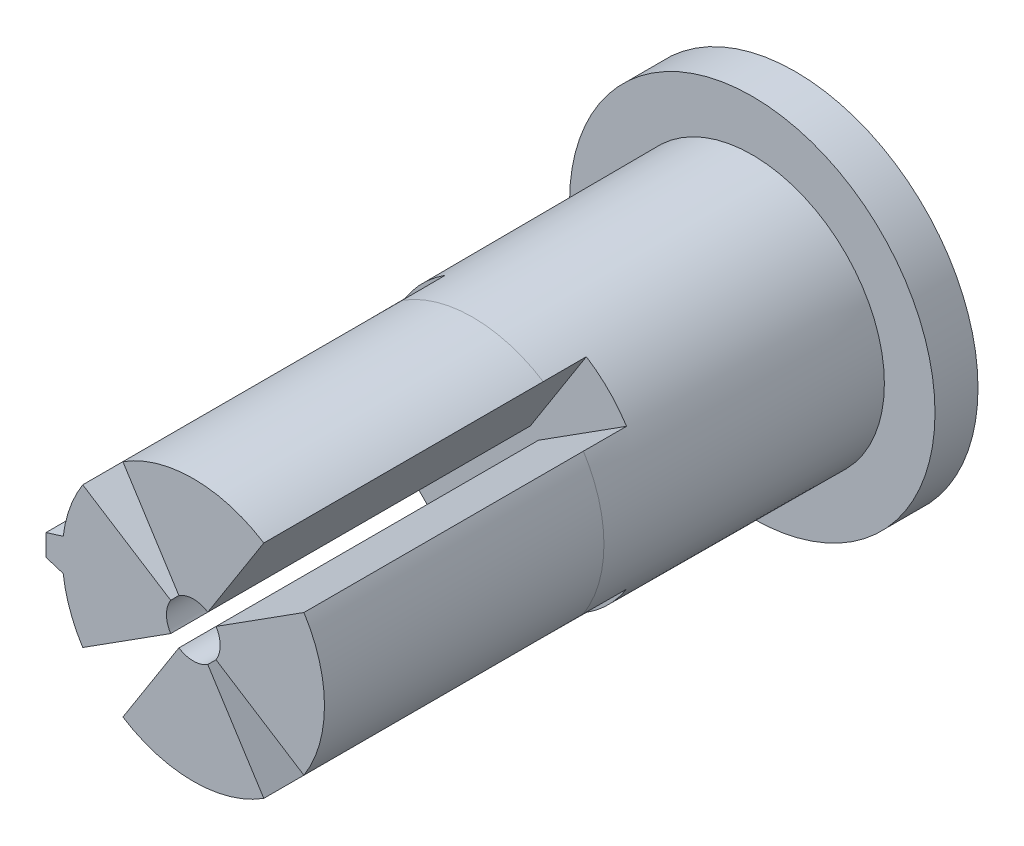
ISO-10303-21;
HEADER;
FILE_DESCRIPTION(('STEP AP214'),'2;1');
FILE_NAME('part.step','',(''),(''),'','','');
FILE_SCHEMA(('AUTOMOTIVE_DESIGN { 1 0 10303 214 1 1 1 1 }'));
ENDSEC;
DATA;
#1=APPLICATION_CONTEXT('core data for automotive mechanical design processes');
#2=APPLICATION_PROTOCOL_DEFINITION('international standard','automotive_design',2000,#1);
#3=PRODUCT_CONTEXT('',#1,'mechanical');
#4=PRODUCT('Part','Part','',(#3));
#5=PRODUCT_RELATED_PRODUCT_CATEGORY('part','',(#4));
#6=PRODUCT_DEFINITION_FORMATION('','',#4);
#7=PRODUCT_DEFINITION_CONTEXT('part definition',#1,'design');
#8=PRODUCT_DEFINITION('design','',#6,#7);
#9=PRODUCT_DEFINITION_SHAPE('','',#8);
#10=(LENGTH_UNIT() NAMED_UNIT(*) SI_UNIT(.MILLI.,.METRE.));
#11=(NAMED_UNIT(*) PLANE_ANGLE_UNIT() SI_UNIT($,.RADIAN.));
#12=(NAMED_UNIT(*) SI_UNIT($,.STERADIAN.) SOLID_ANGLE_UNIT());
#13=UNCERTAINTY_MEASURE_WITH_UNIT(LENGTH_MEASURE(1.E-05),#10,'distance_accuracy_value','');
#14=(GEOMETRIC_REPRESENTATION_CONTEXT(3) GLOBAL_UNCERTAINTY_ASSIGNED_CONTEXT((#13)) GLOBAL_UNIT_ASSIGNED_CONTEXT((#10,
#11,#12)) REPRESENTATION_CONTEXT('',''));
#15=CARTESIAN_POINT('',(0.,0.,0.));
#16=DIRECTION('',(0.,0.,1.));
#17=DIRECTION('',(1.,0.,0.));
#18=AXIS2_PLACEMENT_3D('',#15,#16,#17);
#19=CARTESIAN_POINT('',(0.,0.,13.));
#20=DIRECTION('',(0.,0.,-1.));
#21=DIRECTION('',(-1.,0.,0.));
#22=AXIS2_PLACEMENT_3D('',#19,#20,#21);
#23=CYLINDRICAL_SURFACE('',#22,6.1);
#24=CARTESIAN_POINT('',(0.,0.,13.));
#25=DIRECTION('',(0.,0.,1.));
#26=DIRECTION('',(1.,0.,0.));
#27=AXIS2_PLACEMENT_3D('',#24,#25,#26);
#28=CIRCLE('',#27,6.1);
#29=CARTESIAN_POINT('',(-3.27752761091559,-5.14468781945862,13.));
#30=VERTEX_POINT('',#29);
#31=CARTESIAN_POINT('',(3.27752761091566,-5.14468781945858,13.));
#32=VERTEX_POINT('',#31);
#33=EDGE_CURVE('E377',#30,#32,#28,.T.);
#34=ORIENTED_EDGE('',*,*,#33,.F.);
#35=DIRECTION('',(0.,0.,-1.));
#36=VECTOR('',#35,1.);
#37=CARTESIAN_POINT('',(-3.27752761091559,-5.14468781945862,13.));
#38=LINE('',#37,#36);
#39=CARTESIAN_POINT('',(-3.27752761091559,-5.14468781945862,0.));
#40=VERTEX_POINT('',#39);
#41=EDGE_CURVE('E288',#30,#40,#38,.T.);
#42=ORIENTED_EDGE('',*,*,#41,.T.);
#43=CARTESIAN_POINT('',(0.,0.,0.));
#44=DIRECTION('',(0.,0.,1.));
#45=DIRECTION('',(1.,0.,0.));
#46=AXIS2_PLACEMENT_3D('',#43,#44,#45);
#47=CIRCLE('',#46,6.1);
#48=CARTESIAN_POINT('',(3.27752761091565,-5.14468781945858,0.));
#49=VERTEX_POINT('',#48);
#50=EDGE_CURVE('E411',#40,#49,#47,.T.);
#51=ORIENTED_EDGE('',*,*,#50,.T.);
#52=DIRECTION('',(0.,0.,-1.));
#53=VECTOR('',#52,1.);
#54=CARTESIAN_POINT('',(3.27752761091565,-5.14468781945858,13.));
#55=LINE('',#54,#53);
#56=EDGE_CURVE('E303',#49,#32,#55,.F.);
#57=ORIENTED_EDGE('',*,*,#56,.T.);
#58=EDGE_LOOP('',(#34,#42,#51,#57));
#59=FACE_BOUND('',#58,.T.);
#60=ADVANCED_FACE('F38',(#59),#23,.T.);
#61=CARTESIAN_POINT('',(5.14468781945862,-3.27752761091559,13.));
#62=VERTEX_POINT('',#61);
#63=CARTESIAN_POINT('',(5.14468781945858,3.27752761091565,13.));
#64=VERTEX_POINT('',#63);
#65=EDGE_CURVE('E375',#62,#64,#28,.T.);
#66=ORIENTED_EDGE('',*,*,#65,.F.);
#67=DIRECTION('',(0.,0.,-1.));
#68=VECTOR('',#67,1.);
#69=CARTESIAN_POINT('',(5.14468781945862,-3.27752761091559,13.));
#70=LINE('',#69,#68);
#71=CARTESIAN_POINT('',(5.14468781945862,-3.27752761091559,0.));
#72=VERTEX_POINT('',#71);
#73=EDGE_CURVE('E298',#62,#72,#70,.T.);
#74=ORIENTED_EDGE('',*,*,#73,.T.);
#75=CARTESIAN_POINT('',(5.14468781945858,3.27752761091565,0.));
#76=VERTEX_POINT('',#75);
#77=EDGE_CURVE('E914',#72,#76,#47,.T.);
#78=ORIENTED_EDGE('',*,*,#77,.T.);
#79=DIRECTION('',(0.,0.,-1.));
#80=VECTOR('',#79,1.);
#81=CARTESIAN_POINT('',(5.14468781945858,3.27752761091565,13.));
#82=LINE('',#81,#80);
#83=EDGE_CURVE('E311',#76,#64,#82,.F.);
#84=ORIENTED_EDGE('',*,*,#83,.T.);
#85=EDGE_LOOP('',(#66,#74,#78,#84));
#86=FACE_BOUND('',#85,.T.);
#87=ADVANCED_FACE('F455',(#86),#23,.T.);
#88=CARTESIAN_POINT('',(3.27752761091559,5.14468781945862,13.));
#89=VERTEX_POINT('',#88);
#90=CARTESIAN_POINT('',(-3.27752761091565,5.14468781945858,13.));
#91=VERTEX_POINT('',#90);
#92=EDGE_CURVE('E378',#89,#91,#28,.T.);
#93=ORIENTED_EDGE('',*,*,#92,.F.);
#94=DIRECTION('',(0.,0.,-1.));
#95=VECTOR('',#94,1.);
#96=CARTESIAN_POINT('',(3.27752761091559,5.14468781945862,13.));
#97=LINE('',#96,#95);
#98=CARTESIAN_POINT('',(3.27752761091559,5.14468781945862,0.));
#99=VERTEX_POINT('',#98);
#100=EDGE_CURVE('E233',#89,#99,#97,.T.);
#101=ORIENTED_EDGE('',*,*,#100,.T.);
#102=CARTESIAN_POINT('',(-3.27752761091565,5.14468781945858,0.));
#103=VERTEX_POINT('',#102);
#104=EDGE_CURVE('E887',#99,#103,#47,.T.);
#105=ORIENTED_EDGE('',*,*,#104,.T.);
#106=DIRECTION('',(0.,0.,-1.));
#107=VECTOR('',#106,1.);
#108=CARTESIAN_POINT('',(-3.27752761091565,5.14468781945858,13.));
#109=LINE('',#108,#107);
#110=EDGE_CURVE('E321',#103,#91,#109,.F.);
#111=ORIENTED_EDGE('',*,*,#110,.T.);
#112=EDGE_LOOP('',(#93,#101,#105,#111));
#113=FACE_BOUND('',#112,.T.);
#114=ADVANCED_FACE('F460',(#113),#23,.T.);
#115=CARTESIAN_POINT('',(-5.14468781945862,3.27752761091559,13.));
#116=VERTEX_POINT('',#115);
#117=CARTESIAN_POINT('',(-6.05371786590687,0.75,13.));
#118=VERTEX_POINT('',#117);
#119=EDGE_CURVE('E382',#116,#118,#28,.T.);
#120=ORIENTED_EDGE('',*,*,#119,.F.);
#121=DIRECTION('',(0.,0.,-1.));
#122=VECTOR('',#121,1.);
#123=CARTESIAN_POINT('',(-5.14468781945862,3.27752761091559,13.));
#124=LINE('',#123,#122);
#125=CARTESIAN_POINT('',(-5.14468781945862,3.27752761091559,0.));
#126=VERTEX_POINT('',#125);
#127=EDGE_CURVE('E316',#116,#126,#124,.T.);
#128=ORIENTED_EDGE('',*,*,#127,.T.);
#129=CARTESIAN_POINT('',(-6.05371786590687,0.75,0.));
#130=VERTEX_POINT('',#129);
#131=EDGE_CURVE('E406',#126,#130,#47,.T.);
#132=ORIENTED_EDGE('',*,*,#131,.T.);
#133=DIRECTION('',(0.,0.,-1.));
#134=VECTOR('',#133,1.);
#135=CARTESIAN_POINT('',(-6.05371786590687,0.75,13.));
#136=LINE('',#135,#134);
#137=EDGE_CURVE('E403',#118,#130,#136,.T.);
#138=ORIENTED_EDGE('',*,*,#137,.F.);
#139=EDGE_LOOP('',(#120,#128,#132,#138));
#140=FACE_BOUND('',#139,.T.);
#141=ADVANCED_FACE('F451',(#140),#23,.T.);
#142=CARTESIAN_POINT('',(0.,0.,13.));
#143=DIRECTION('',(0.,0.,1.));
#144=DIRECTION('',(1.,0.,0.));
#145=AXIS2_PLACEMENT_3D('',#142,#143,#144);
#146=PLANE('',#145);
#147=DIRECTION('',(0.537299608346819,0.843391445812889,0.));
#148=VECTOR('',#147,1.);
#149=CARTESIAN_POINT('',(-0.671624510433523,-1.05423930726611,13.));
#150=LINE('',#149,#148);
#151=CARTESIAN_POINT('',(-0.671624510433523,-1.05423930726611,13.));
#152=VERTEX_POINT('',#151);
#153=EDGE_CURVE('E341',#30,#152,#150,.T.);
#154=ORIENTED_EDGE('',*,*,#153,.F.);
#155=ORIENTED_EDGE('',*,*,#33,.T.);
#156=DIRECTION('',(0.537299608346829,-0.843391445812883,0.));
#157=VECTOR('',#156,1.);
#158=CARTESIAN_POINT('',(0.671624510433536,-1.0542393072661,13.));
#159=LINE('',#158,#157);
#160=CARTESIAN_POINT('',(0.671624510433536,-1.0542393072661,13.));
#161=VERTEX_POINT('',#160);
#162=EDGE_CURVE('E250',#161,#32,#159,.T.);
#163=ORIENTED_EDGE('',*,*,#162,.F.);
#164=CARTESIAN_POINT('',(0.,0.,13.));
#165=DIRECTION('',(0.,0.,1.));
#166=DIRECTION('',(1.,0.,0.));
#167=AXIS2_PLACEMENT_3D('',#164,#165,#166);
#168=CIRCLE('',#167,1.25);
#169=EDGE_CURVE('E263',#152,#161,#168,.T.);
#170=ORIENTED_EDGE('',*,*,#169,.F.);
#171=EDGE_LOOP('',(#154,#155,#163,#170));
#172=FACE_BOUND('',#171,.T.);
#173=ADVANCED_FACE('F479',(#172),#146,.T.);
#174=DIRECTION('',(-0.843391445812889,0.537299608346819,0.));
#175=VECTOR('',#174,1.);
#176=CARTESIAN_POINT('',(1.05423930726611,-0.671624510433523,13.));
#177=LINE('',#176,#175);
#178=CARTESIAN_POINT('',(1.05423930726611,-0.671624510433523,13.));
#179=VERTEX_POINT('',#178);
#180=EDGE_CURVE('E353',#62,#179,#177,.T.);
#181=ORIENTED_EDGE('',*,*,#180,.F.);
#182=ORIENTED_EDGE('',*,*,#65,.T.);
#183=DIRECTION('',(0.843391445812883,0.537299608346829,0.));
#184=VECTOR('',#183,1.);
#185=CARTESIAN_POINT('',(1.0542393072661,0.671624510433536,13.));
#186=LINE('',#185,#184);
#187=CARTESIAN_POINT('',(1.0542393072661,0.671624510433536,13.));
#188=VERTEX_POINT('',#187);
#189=EDGE_CURVE('E238',#188,#64,#186,.T.);
#190=ORIENTED_EDGE('',*,*,#189,.F.);
#191=EDGE_CURVE('E258',#179,#188,#168,.T.);
#192=ORIENTED_EDGE('',*,*,#191,.F.);
#193=EDGE_LOOP('',(#181,#182,#190,#192));
#194=FACE_BOUND('',#193,.T.);
#195=ADVANCED_FACE('F373',(#194),#146,.T.);
#196=DIRECTION('',(-0.537299608346819,-0.843391445812889,0.));
#197=VECTOR('',#196,1.);
#198=CARTESIAN_POINT('',(0.671624510433523,1.05423930726611,13.));
#199=LINE('',#198,#197);
#200=CARTESIAN_POINT('',(0.671624510433523,1.05423930726611,13.));
#201=VERTEX_POINT('',#200);
#202=EDGE_CURVE('E226',#89,#201,#199,.T.);
#203=ORIENTED_EDGE('',*,*,#202,.F.);
#204=ORIENTED_EDGE('',*,*,#92,.T.);
#205=DIRECTION('',(-0.537299608346828,0.843391445812883,0.));
#206=VECTOR('',#205,1.);
#207=CARTESIAN_POINT('',(-0.671624510433536,1.0542393072661,13.));
#208=LINE('',#207,#206);
#209=CARTESIAN_POINT('',(-0.671624510433536,1.0542393072661,13.));
#210=VERTEX_POINT('',#209);
#211=EDGE_CURVE('E254',#210,#91,#208,.T.);
#212=ORIENTED_EDGE('',*,*,#211,.F.);
#213=EDGE_CURVE('E246',#201,#210,#168,.T.);
#214=ORIENTED_EDGE('',*,*,#213,.F.);
#215=EDGE_LOOP('',(#203,#204,#212,#214));
#216=FACE_BOUND('',#215,.T.);
#217=ADVANCED_FACE('F253',(#216),#146,.T.);
#218=CARTESIAN_POINT('',(0.,0.,-2.));
#219=DIRECTION('',(0.,0.,1.));
#220=DIRECTION('',(1.,0.,0.));
#221=AXIS2_PLACEMENT_3D('',#218,#219,#220);
#222=CYLINDRICAL_SURFACE('',#221,1.25);
#223=CARTESIAN_POINT('',(0.,0.,-2.));
#224=DIRECTION('',(0.,0.,1.));
#225=DIRECTION('',(1.,0.,0.));
#226=AXIS2_PLACEMENT_3D('',#223,#224,#225);
#227=CIRCLE('',#226,1.25);
#228=CARTESIAN_POINT('',(-0.671624510433523,-1.05423930726611,-2.));
#229=VERTEX_POINT('',#228);
#230=CARTESIAN_POINT('',(0.671624510433536,-1.0542393072661,-2.));
#231=VERTEX_POINT('',#230);
#232=EDGE_CURVE('E260',#229,#231,#227,.T.);
#233=ORIENTED_EDGE('',*,*,#232,.F.);
#234=DIRECTION('',(0.,0.,1.));
#235=VECTOR('',#234,1.);
#236=CARTESIAN_POINT('',(-0.671624510433523,-1.05423930726611,-2.));
#237=LINE('',#236,#235);
#238=EDGE_CURVE('E63',#229,#152,#237,.T.);
#239=ORIENTED_EDGE('',*,*,#238,.T.);
#240=ORIENTED_EDGE('',*,*,#169,.T.);
#241=DIRECTION('',(0.,0.,1.));
#242=VECTOR('',#241,1.);
#243=CARTESIAN_POINT('',(0.671624510433536,-1.0542393072661,-2.));
#244=LINE('',#243,#242);
#245=EDGE_CURVE('E356',#231,#161,#244,.T.);
#246=ORIENTED_EDGE('',*,*,#245,.F.);
#247=EDGE_LOOP('',(#233,#239,#240,#246));
#248=FACE_BOUND('',#247,.T.);
#249=ADVANCED_FACE('F508',(#248),#222,.F.);
#250=CARTESIAN_POINT('',(1.05423930726611,-0.671624510433523,-2.));
#251=VERTEX_POINT('',#250);
#252=CARTESIAN_POINT('',(1.0542393072661,0.671624510433536,-2.));
#253=VERTEX_POINT('',#252);
#254=EDGE_CURVE('E255',#251,#253,#227,.T.);
#255=ORIENTED_EDGE('',*,*,#254,.F.);
#256=DIRECTION('',(0.,0.,1.));
#257=VECTOR('',#256,1.);
#258=CARTESIAN_POINT('',(1.05423930726611,-0.671624510433523,-2.));
#259=LINE('',#258,#257);
#260=EDGE_CURVE('E55',#251,#179,#259,.T.);
#261=ORIENTED_EDGE('',*,*,#260,.T.);
#262=ORIENTED_EDGE('',*,*,#191,.T.);
#263=DIRECTION('',(0.,0.,1.));
#264=VECTOR('',#263,1.);
#265=CARTESIAN_POINT('',(1.0542393072661,0.671624510433536,-2.));
#266=LINE('',#265,#264);
#267=EDGE_CURVE('E249',#253,#188,#266,.T.);
#268=ORIENTED_EDGE('',*,*,#267,.F.);
#269=EDGE_LOOP('',(#255,#261,#262,#268));
#270=FACE_BOUND('',#269,.T.);
#271=ADVANCED_FACE('F666',(#270),#222,.F.);
#272=CARTESIAN_POINT('',(0.671624510433523,1.05423930726611,-2.));
#273=VERTEX_POINT('',#272);
#274=CARTESIAN_POINT('',(-0.671624510433536,1.0542393072661,-2.));
#275=VERTEX_POINT('',#274);
#276=EDGE_CURVE('E248',#273,#275,#227,.T.);
#277=ORIENTED_EDGE('',*,*,#276,.F.);
#278=DIRECTION('',(0.,0.,1.));
#279=VECTOR('',#278,1.);
#280=CARTESIAN_POINT('',(0.671624510433523,1.05423930726611,-2.));
#281=LINE('',#280,#279);
#282=EDGE_CURVE('E230',#273,#201,#281,.T.);
#283=ORIENTED_EDGE('',*,*,#282,.T.);
#284=ORIENTED_EDGE('',*,*,#213,.T.);
#285=DIRECTION('',(0.,0.,1.));
#286=VECTOR('',#285,1.);
#287=CARTESIAN_POINT('',(-0.671624510433536,1.0542393072661,-2.));
#288=LINE('',#287,#286);
#289=EDGE_CURVE('E325',#275,#210,#288,.T.);
#290=ORIENTED_EDGE('',*,*,#289,.F.);
#291=EDGE_LOOP('',(#277,#283,#284,#290));
#292=FACE_BOUND('',#291,.T.);
#293=ADVANCED_FACE('F244',(#292),#222,.F.);
#294=CARTESIAN_POINT('',(0.,0.,0.));
#295=DIRECTION('',(0.,0.,-1.));
#296=DIRECTION('',(1.,0.,0.));
#297=AXIS2_PLACEMENT_3D('',#294,#295,#296);
#298=CONICAL_SURFACE('',#297,6.1,0.00349065850398867);
#299=DIRECTION('',(-0.00187552563827498,-0.00294398554391436,-0.99999390765779));
#300=VECTOR('',#299,1.);
#301=CARTESIAN_POINT('',(0.,0.,1747.51417747095));
#302=LINE('',#301,#300);
#303=CARTESIAN_POINT('',(-3.28127868504497,-5.1505758264182,-2.));
#304=VERTEX_POINT('',#303);
#305=EDGE_CURVE('E286',#304,#40,#302,.F.);
#306=ORIENTED_EDGE('',*,*,#305,.F.);
#307=CARTESIAN_POINT('',(0.,0.,-2.));
#308=DIRECTION('',(0.,0.,1.));
#309=DIRECTION('',(1.,0.,0.));
#310=AXIS2_PLACEMENT_3D('',#307,#308,#309);
#311=CIRCLE('',#310,6.10698134536319);
#312=CARTESIAN_POINT('',(-5.15057582641816,-3.28127868504503,-2.));
#313=VERTEX_POINT('',#312);
#314=EDGE_CURVE('E266',#304,#313,#311,.F.);
#315=ORIENTED_EDGE('',*,*,#314,.T.);
#316=DIRECTION('',(0.00294398554391434,0.00187552563827502,0.999993907657791));
#317=VECTOR('',#316,1.);
#318=CARTESIAN_POINT('',(0.,0.,1747.51417747095));
#319=LINE('',#318,#317);
#320=CARTESIAN_POINT('',(-5.14468781945858,-3.27752761091565,0.));
#321=VERTEX_POINT('',#320);
#322=EDGE_CURVE('E291',#321,#313,#319,.F.);
#323=ORIENTED_EDGE('',*,*,#322,.F.);
#324=CARTESIAN_POINT('',(-6.05371786590687,-0.75,0.));
#325=VERTEX_POINT('',#324);
#326=EDGE_CURVE('E407',#325,#321,#47,.T.);
#327=ORIENTED_EDGE('',*,*,#326,.F.);
#328=CARTESIAN_POINT('',(-6.09508474462202,-0.784615749053169,-13.));
#329=CARTESIAN_POINT('',(-6.08820240831536,-0.778842662602694,-10.833333304797));
#330=CARTESIAN_POINT('',(-6.08131400026911,-0.773071473623027,-8.66666662386222));
#331=CARTESIAN_POINT('',(-6.06752504069739,-0.761532890605304,-4.33333329052888));
#332=CARTESIAN_POINT('',(-6.06062448917193,-0.755765496567249,-2.16666663813034));
#333=CARTESIAN_POINT('',(-6.05371786590687,-0.75,0.));
#334=B_SPLINE_CURVE_WITH_KNOTS('',3,(#328,#329,#330,#331,#332,#333),.UNSPECIFIED.,.F.,.F.,(4,2,
4),(0.,6.50005595110887,13.0001119022181),.UNSPECIFIED.);
#335=CARTESIAN_POINT('',(-6.09508474462202,-0.784615749053169,-13.));
#336=VERTEX_POINT('',#335);
#337=EDGE_CURVE('E11',#336,#325,#334,.T.);
#338=ORIENTED_EDGE('',*,*,#337,.F.);
#339=CARTESIAN_POINT('',(0.,0.,-13.));
#340=DIRECTION('',(0.,0.,1.));
#341=DIRECTION('',(1.,0.,0.));
#342=AXIS2_PLACEMENT_3D('',#339,#340,#341);
#343=CIRCLE('',#342,6.14537874486075);
#344=CARTESIAN_POINT('',(-6.09508474462202,0.784615749053169,-13.));
#345=VERTEX_POINT('',#344);
#346=EDGE_CURVE('E419',#336,#345,#343,.T.);
#347=ORIENTED_EDGE('',*,*,#346,.T.);
#348=CARTESIAN_POINT('',(-6.09508474462202,0.784615749053169,-13.));
#349=CARTESIAN_POINT('',(-6.08820240831536,0.778842662602694,-10.833333304797));
#350=CARTESIAN_POINT('',(-6.08131400026911,0.773071473623027,-8.66666662386222));
#351=CARTESIAN_POINT('',(-6.06752504069739,0.761532890605304,-4.33333329052888));
#352=CARTESIAN_POINT('',(-6.06062448917193,0.755765496567249,-2.16666663813034));
#353=CARTESIAN_POINT('',(-6.05371786590687,0.75,0.));
#354=B_SPLINE_CURVE_WITH_KNOTS('',3,(#348,#349,#350,#351,#352,#353),.UNSPECIFIED.,.F.,.F.,(4,2,
4),(0.,6.50005595110887,13.0001119022181),.UNSPECIFIED.);
#355=EDGE_CURVE('E427',#345,#130,#354,.T.);
#356=ORIENTED_EDGE('',*,*,#355,.T.);
#357=ORIENTED_EDGE('',*,*,#131,.F.);
#358=DIRECTION('',(-0.00294398554391436,0.00187552563827498,-0.99999390765779));
#359=VECTOR('',#358,1.);
#360=CARTESIAN_POINT('',(0.,0.,1747.51417747095));
#361=LINE('',#360,#359);
#362=CARTESIAN_POINT('',(-5.1505758264182,3.28127868504497,-2.));
#363=VERTEX_POINT('',#362);
#364=EDGE_CURVE('E314',#363,#126,#361,.F.);
#365=ORIENTED_EDGE('',*,*,#364,.F.);
#366=CARTESIAN_POINT('',(0.,0.,-2.));
#367=DIRECTION('',(0.,0.,1.));
#368=DIRECTION('',(1.,0.,0.));
#369=AXIS2_PLACEMENT_3D('',#366,#367,#368);
#370=CIRCLE('',#369,6.10698134536319);
#371=CARTESIAN_POINT('',(-3.28127868504503,5.15057582641817,-2.));
#372=VERTEX_POINT('',#371);
#373=EDGE_CURVE('E283',#363,#372,#370,.F.);
#374=ORIENTED_EDGE('',*,*,#373,.T.);
#375=DIRECTION('',(0.00187552563827502,-0.00294398554391434,0.999993907657791));
#376=VECTOR('',#375,1.);
#377=CARTESIAN_POINT('',(0.,0.,1747.51417747095));
#378=LINE('',#377,#376);
#379=EDGE_CURVE('E319',#103,#372,#378,.F.);
#380=ORIENTED_EDGE('',*,*,#379,.F.);
#381=ORIENTED_EDGE('',*,*,#104,.F.);
#382=DIRECTION('',(0.00187552563827498,0.00294398554391436,-0.99999390765779));
#383=VECTOR('',#382,1.);
#384=CARTESIAN_POINT('',(0.,0.,1747.51417747095));
#385=LINE('',#384,#383);
#386=CARTESIAN_POINT('',(3.28127868504497,5.1505758264182,-2.));
#387=VERTEX_POINT('',#386);
#388=EDGE_CURVE('E306',#387,#99,#385,.F.);
#389=ORIENTED_EDGE('',*,*,#388,.F.);
#390=CARTESIAN_POINT('',(0.,0.,-2.));
#391=DIRECTION('',(0.,0.,1.));
#392=DIRECTION('',(1.,0.,0.));
#393=AXIS2_PLACEMENT_3D('',#390,#391,#392);
#394=CIRCLE('',#393,6.10698134536319);
#395=CARTESIAN_POINT('',(5.15057582641817,3.28127868504503,-2.));
#396=VERTEX_POINT('',#395);
#397=EDGE_CURVE('E278',#387,#396,#394,.F.);
#398=ORIENTED_EDGE('',*,*,#397,.T.);
#399=DIRECTION('',(-0.00294398554391433,-0.00187552563827502,0.99999390765779));
#400=VECTOR('',#399,1.);
#401=CARTESIAN_POINT('',(0.,0.,1747.51417747095));
#402=LINE('',#401,#400);
#403=EDGE_CURVE('E309',#76,#396,#402,.F.);
#404=ORIENTED_EDGE('',*,*,#403,.F.);
#405=ORIENTED_EDGE('',*,*,#77,.F.);
#406=DIRECTION('',(0.00294398554391436,-0.00187552563827498,-0.99999390765779));
#407=VECTOR('',#406,1.);
#408=CARTESIAN_POINT('',(0.,0.,1747.51417747095));
#409=LINE('',#408,#407);
#410=CARTESIAN_POINT('',(5.1505758264182,-3.28127868504497,-2.));
#411=VERTEX_POINT('',#410);
#412=EDGE_CURVE('E296',#411,#72,#409,.F.);
#413=ORIENTED_EDGE('',*,*,#412,.F.);
#414=CARTESIAN_POINT('',(0.,0.,-2.));
#415=DIRECTION('',(0.,0.,1.));
#416=DIRECTION('',(1.,0.,0.));
#417=AXIS2_PLACEMENT_3D('',#414,#415,#416);
#418=CIRCLE('',#417,6.10698134536319);
#419=CARTESIAN_POINT('',(3.28127868504503,-5.15057582641817,-2.));
#420=VERTEX_POINT('',#419);
#421=EDGE_CURVE('E272',#411,#420,#418,.F.);
#422=ORIENTED_EDGE('',*,*,#421,.T.);
#423=DIRECTION('',(-0.00187552563827502,0.00294398554391433,0.99999390765779));
#424=VECTOR('',#423,1.);
#425=CARTESIAN_POINT('',(0.,0.,1747.51417747095));
#426=LINE('',#425,#424);
#427=EDGE_CURVE('E301',#49,#420,#426,.F.);
#428=ORIENTED_EDGE('',*,*,#427,.F.);
#429=ORIENTED_EDGE('',*,*,#50,.F.);
#430=EDGE_LOOP('',(#306,#315,#323,#327,#338,#347,#356,#357,#365,#374,#380,#381,#389,#398,#404,
#405,#413,#422,#428,#429));
#431=FACE_BOUND('',#430,.T.);
#432=ADVANCED_FACE('F433',(#431),#298,.T.);
#433=CARTESIAN_POINT('',(-6.05371786590687,-0.75,0.));
#434=DIRECTION('',(-0.298273175942616,-0.954474163016371,0.00349065141522374));
#435=DIRECTION('',(0.95447997803503,-0.298274993135947,0.));
#436=AXIS2_PLACEMENT_3D('',#433,#434,#435);
#437=PLANE('',#436);
#438=DIRECTION('',(0.95447997803503,-0.298274993135947,0.));
#439=VECTOR('',#438,1.);
#440=CARTESIAN_POINT('',(-6.05371786590687,-0.75,0.));
#441=LINE('',#440,#439);
#442=CARTESIAN_POINT('',(-6.85371786590687,-0.5,0.));
#443=VERTEX_POINT('',#442);
#444=EDGE_CURVE('E417',#443,#325,#441,.T.);
#445=ORIENTED_EDGE('',*,*,#444,.F.);
#446=DIRECTION('',(0.00349063992079044,0.00256628675168157,0.999990614758584));
#447=VECTOR('',#446,1.);
#448=CARTESIAN_POINT('',(-6.85371786590687,-0.5,0.));
#449=LINE('',#448,#447);
#450=CARTESIAN_POINT('',(-6.89909661076762,-0.533362040882668,-13.));
#451=VERTEX_POINT('',#450);
#452=EDGE_CURVE('E47',#451,#443,#449,.T.);
#453=ORIENTED_EDGE('',*,*,#452,.F.);
#454=DIRECTION('',(0.95447997803503,-0.298274993135947,0.));
#455=VECTOR('',#454,1.);
#456=CARTESIAN_POINT('',(-0.765645475230618,-2.45006552073798,-13.));
#457=LINE('',#456,#455);
#458=EDGE_CURVE('E893',#451,#336,#457,.T.);
#459=ORIENTED_EDGE('',*,*,#458,.T.);
#460=ORIENTED_EDGE('',*,*,#337,.T.);
#461=EDGE_LOOP('',(#445,#453,#459,#460));
#462=FACE_BOUND('',#461,.T.);
#463=ADVANCED_FACE('F436',(#462),#437,.T.);
#464=CARTESIAN_POINT('',(-6.85371786590687,-0.5,0.));
#465=DIRECTION('',(-0.99999390765779,0.,0.00349065141522374));
#466=DIRECTION('',(0.00349065141522374,0.,0.99999390765779));
#467=AXIS2_PLACEMENT_3D('',#464,#465,#466);
#468=PLANE('',#467);
#469=DIRECTION('',(0.,-1.,0.));
#470=VECTOR('',#469,1.);
#471=CARTESIAN_POINT('',(-6.85371786590687,-0.5,0.));
#472=LINE('',#471,#470);
#473=CARTESIAN_POINT('',(-6.85371786590687,0.5,0.));
#474=VERTEX_POINT('',#473);
#475=EDGE_CURVE('E414',#474,#443,#472,.T.);
#476=ORIENTED_EDGE('',*,*,#475,.F.);
#477=DIRECTION('',(0.00349063992079044,-0.00256628675168157,0.999990614758584));
#478=VECTOR('',#477,1.);
#479=CARTESIAN_POINT('',(-6.85371786590687,0.5,0.));
#480=LINE('',#479,#478);
#481=CARTESIAN_POINT('',(-6.89909661076762,0.533362040882668,-13.));
#482=VERTEX_POINT('',#481);
#483=EDGE_CURVE('E892',#482,#474,#480,.T.);
#484=ORIENTED_EDGE('',*,*,#483,.F.);
#485=DIRECTION('',(0.,-1.,0.));
#486=VECTOR('',#485,1.);
#487=CARTESIAN_POINT('',(-6.89909661076762,0.,-13.));
#488=LINE('',#487,#486);
#489=EDGE_CURVE('E904',#482,#451,#488,.T.);
#490=ORIENTED_EDGE('',*,*,#489,.T.);
#491=ORIENTED_EDGE('',*,*,#452,.T.);
#492=EDGE_LOOP('',(#476,#484,#490,#491));
#493=FACE_BOUND('',#492,.T.);
#494=ADVANCED_FACE('F40',(#493),#468,.T.);
#495=CARTESIAN_POINT('',(-6.85371786590687,0.5,0.));
#496=DIRECTION('',(-0.298273175942616,0.954474163016371,0.00349065141522374));
#497=DIRECTION('',(-0.95447997803503,-0.298274993135947,0.));
#498=AXIS2_PLACEMENT_3D('',#495,#496,#497);
#499=PLANE('',#498);
#500=DIRECTION('',(-0.95447997803503,-0.298274993135947,0.));
#501=VECTOR('',#500,1.);
#502=CARTESIAN_POINT('',(-6.85371786590687,0.5,0.));
#503=LINE('',#502,#501);
#504=EDGE_CURVE('E410',#130,#474,#503,.T.);
#505=ORIENTED_EDGE('',*,*,#504,.F.);
#506=ORIENTED_EDGE('',*,*,#355,.F.);
#507=DIRECTION('',(-0.95447997803503,-0.298274993135947,0.));
#508=VECTOR('',#507,1.);
#509=CARTESIAN_POINT('',(-0.765645475230619,2.45006552073798,-13.));
#510=LINE('',#509,#508);
#511=EDGE_CURVE('E42',#345,#482,#510,.T.);
#512=ORIENTED_EDGE('',*,*,#511,.T.);
#513=ORIENTED_EDGE('',*,*,#483,.T.);
#514=EDGE_LOOP('',(#505,#506,#512,#513));
#515=FACE_BOUND('',#514,.T.);
#516=ADVANCED_FACE('F440',(#515),#499,.T.);
#517=ORIENTED_EDGE('',*,*,#326,.T.);
#518=DIRECTION('',(0.,0.,-1.));
#519=VECTOR('',#518,1.);
#520=CARTESIAN_POINT('',(-5.14468781945858,-3.27752761091565,13.));
#521=LINE('',#520,#519);
#522=CARTESIAN_POINT('',(-5.14468781945858,-3.27752761091566,13.));
#523=VERTEX_POINT('',#522);
#524=EDGE_CURVE('E293',#321,#523,#521,.F.);
#525=ORIENTED_EDGE('',*,*,#524,.T.);
#526=CARTESIAN_POINT('',(-6.05371786590687,-0.75,13.));
#527=VERTEX_POINT('',#526);
#528=EDGE_CURVE('E381',#527,#523,#28,.T.);
#529=ORIENTED_EDGE('',*,*,#528,.F.);
#530=DIRECTION('',(0.,0.,-1.));
#531=VECTOR('',#530,1.);
#532=CARTESIAN_POINT('',(-6.05371786590687,-0.75,13.));
#533=LINE('',#532,#531);
#534=EDGE_CURVE('E394',#527,#325,#533,.T.);
#535=ORIENTED_EDGE('',*,*,#534,.T.);
#536=EDGE_LOOP('',(#517,#525,#529,#535));
#537=FACE_BOUND('',#536,.T.);
#538=ADVANCED_FACE('F443',(#537),#23,.T.);
#539=CARTESIAN_POINT('',(-6.85371786590687,0.5,13.));
#540=DIRECTION('',(0.298274993135947,-0.95447997803503,0.));
#541=DIRECTION('',(0.95447997803503,0.298274993135947,0.));
#542=AXIS2_PLACEMENT_3D('',#539,#540,#541);
#543=PLANE('',#542);
#544=ORIENTED_EDGE('',*,*,#504,.T.);
#545=DIRECTION('',(0.,0.,-1.));
#546=VECTOR('',#545,1.);
#547=CARTESIAN_POINT('',(-6.85371786590687,0.5,13.));
#548=LINE('',#547,#546);
#549=CARTESIAN_POINT('',(-6.85371786590687,0.5,13.));
#550=VERTEX_POINT('',#549);
#551=EDGE_CURVE('E400',#550,#474,#548,.T.);
#552=ORIENTED_EDGE('',*,*,#551,.F.);
#553=DIRECTION('',(-0.95447997803503,-0.298274993135947,0.));
#554=VECTOR('',#553,1.);
#555=CARTESIAN_POINT('',(-6.85371786590687,0.5,13.));
#556=LINE('',#555,#554);
#557=EDGE_CURVE('E386',#118,#550,#556,.T.);
#558=ORIENTED_EDGE('',*,*,#557,.F.);
#559=ORIENTED_EDGE('',*,*,#137,.T.);
#560=EDGE_LOOP('',(#544,#552,#558,#559));
#561=FACE_BOUND('',#560,.T.);
#562=ADVANCED_FACE('F449',(#561),#543,.F.);
#563=CARTESIAN_POINT('',(-6.85371786590687,-0.5,13.));
#564=DIRECTION('',(1.,0.,0.));
#565=DIRECTION('',(0.,0.,-1.));
#566=AXIS2_PLACEMENT_3D('',#563,#564,#565);
#567=PLANE('',#566);
#568=ORIENTED_EDGE('',*,*,#475,.T.);
#569=DIRECTION('',(0.,0.,-1.));
#570=VECTOR('',#569,1.);
#571=CARTESIAN_POINT('',(-6.85371786590687,-0.5,13.));
#572=LINE('',#571,#570);
#573=CARTESIAN_POINT('',(-6.85371786590687,-0.5,13.));
#574=VERTEX_POINT('',#573);
#575=EDGE_CURVE('E397',#574,#443,#572,.T.);
#576=ORIENTED_EDGE('',*,*,#575,.F.);
#577=DIRECTION('',(0.,-1.,0.));
#578=VECTOR('',#577,1.);
#579=CARTESIAN_POINT('',(-6.85371786590687,-0.5,13.));
#580=LINE('',#579,#578);
#581=EDGE_CURVE('E390',#550,#574,#580,.T.);
#582=ORIENTED_EDGE('',*,*,#581,.F.);
#583=ORIENTED_EDGE('',*,*,#551,.T.);
#584=EDGE_LOOP('',(#568,#576,#582,#583));
#585=FACE_BOUND('',#584,.T.);
#586=ADVANCED_FACE('F465',(#585),#567,.F.);
#587=CARTESIAN_POINT('',(-6.05371786590687,-0.75,13.));
#588=DIRECTION('',(0.298274993135947,0.95447997803503,0.));
#589=DIRECTION('',(-0.95447997803503,0.298274993135947,0.));
#590=AXIS2_PLACEMENT_3D('',#587,#588,#589);
#591=PLANE('',#590);
#592=ORIENTED_EDGE('',*,*,#444,.T.);
#593=ORIENTED_EDGE('',*,*,#534,.F.);
#594=DIRECTION('',(0.95447997803503,-0.298274993135947,0.));
#595=VECTOR('',#594,1.);
#596=CARTESIAN_POINT('',(-6.05371786590687,-0.75,13.));
#597=LINE('',#596,#595);
#598=EDGE_CURVE('E392',#574,#527,#597,.T.);
#599=ORIENTED_EDGE('',*,*,#598,.F.);
#600=ORIENTED_EDGE('',*,*,#575,.T.);
#601=EDGE_LOOP('',(#592,#593,#599,#600));
#602=FACE_BOUND('',#601,.T.);
#603=ADVANCED_FACE('F469',(#602),#591,.F.);
#604=DIRECTION('',(-0.843391445812883,-0.537299608346829,0.));
#605=VECTOR('',#604,1.);
#606=CARTESIAN_POINT('',(-1.0542393072661,-0.671624510433536,13.));
#607=LINE('',#606,#605);
#608=CARTESIAN_POINT('',(-1.0542393072661,-0.671624510433536,13.));
#609=VERTEX_POINT('',#608);
#610=EDGE_CURVE('E345',#609,#523,#607,.T.);
#611=ORIENTED_EDGE('',*,*,#610,.F.);
#612=CARTESIAN_POINT('',(-1.05423930726611,0.671624510433523,13.));
#613=VERTEX_POINT('',#612);
#614=EDGE_CURVE('E256',#613,#609,#168,.T.);
#615=ORIENTED_EDGE('',*,*,#614,.F.);
#616=DIRECTION('',(0.843391445812889,-0.537299608346819,0.));
#617=VECTOR('',#616,1.);
#618=CARTESIAN_POINT('',(-1.05423930726611,0.671624510433523,13.));
#619=LINE('',#618,#617);
#620=EDGE_CURVE('E330',#116,#613,#619,.T.);
#621=ORIENTED_EDGE('',*,*,#620,.F.);
#622=ORIENTED_EDGE('',*,*,#119,.T.);
#623=ORIENTED_EDGE('',*,*,#557,.T.);
#624=ORIENTED_EDGE('',*,*,#581,.T.);
#625=ORIENTED_EDGE('',*,*,#598,.T.);
#626=ORIENTED_EDGE('',*,*,#528,.T.);
#627=EDGE_LOOP('',(#611,#615,#621,#622,#623,#624,#625,#626));
#628=FACE_BOUND('',#627,.T.);
#629=ADVANCED_FACE('F473',(#628),#146,.T.);
#630=CARTESIAN_POINT('',(0.,0.,-15.));
#631=DIRECTION('',(0.,0.,1.));
#632=DIRECTION('',(1.,0.,0.));
#633=AXIS2_PLACEMENT_3D('',#630,#631,#632);
#634=CYLINDRICAL_SURFACE('',#633,8.5);
#635=CARTESIAN_POINT('',(0.,0.,-15.));
#636=DIRECTION('',(0.,0.,-1.));
#637=DIRECTION('',(-1.,0.,0.));
#638=AXIS2_PLACEMENT_3D('',#635,#636,#637);
#639=CIRCLE('',#638,8.5);
#640=CARTESIAN_POINT('',(-8.5,0.,-15.));
#641=VERTEX_POINT('',#640);
#642=EDGE_CURVE('E868',#641,#641,#639,.T.);
#643=ORIENTED_EDGE('',*,*,#642,.F.);
#644=EDGE_LOOP('',(#643));
#645=FACE_BOUND('',#644,.T.);
#646=CARTESIAN_POINT('',(0.,0.,-13.));
#647=DIRECTION('',(0.,0.,-1.));
#648=DIRECTION('',(-1.,0.,0.));
#649=AXIS2_PLACEMENT_3D('',#646,#647,#648);
#650=CIRCLE('',#649,8.5);
#651=CARTESIAN_POINT('',(-8.5,0.,-13.));
#652=VERTEX_POINT('',#651);
#653=EDGE_CURVE('E387',#652,#652,#650,.T.);
#654=ORIENTED_EDGE('',*,*,#653,.T.);
#655=EDGE_LOOP('',(#654));
#656=FACE_BOUND('',#655,.T.);
#657=ADVANCED_FACE('F477',(#645,#656),#634,.T.);
#658=CARTESIAN_POINT('',(0.,0.,-15.));
#659=DIRECTION('',(0.,0.,-1.));
#660=DIRECTION('',(-1.,0.,0.));
#661=AXIS2_PLACEMENT_3D('',#658,#659,#660);
#662=PLANE('',#661);
#663=CARTESIAN_POINT('',(0.,0.,-15.));
#664=DIRECTION('',(0.,0.,-1.));
#665=DIRECTION('',(-1.,0.,0.));
#666=AXIS2_PLACEMENT_3D('',#663,#664,#665);
#667=CIRCLE('',#666,3.1);
#668=CARTESIAN_POINT('',(-2.5,1.83303027798234,-15.));
#669=VERTEX_POINT('',#668);
#670=CARTESIAN_POINT('',(-2.5,-1.83303027798234,-15.));
#671=VERTEX_POINT('',#670);
#672=EDGE_CURVE('E854',#669,#671,#667,.T.);
#673=ORIENTED_EDGE('',*,*,#672,.F.);
#674=DIRECTION('',(0.,1.,0.));
#675=VECTOR('',#674,1.);
#676=CARTESIAN_POINT('',(-2.5,1.83303027798234,-15.));
#677=LINE('',#676,#675);
#678=EDGE_CURVE('E855',#671,#669,#677,.T.);
#679=ORIENTED_EDGE('',*,*,#678,.F.);
#680=EDGE_LOOP('',(#673,#679));
#681=FACE_BOUND('',#680,.T.);
#682=ORIENTED_EDGE('',*,*,#642,.T.);
#683=EDGE_LOOP('',(#682));
#684=FACE_BOUND('',#683,.T.);
#685=ADVANCED_FACE('F482',(#681,#684),#662,.T.);
#686=CARTESIAN_POINT('',(0.,0.,-13.));
#687=DIRECTION('',(0.,0.,-1.));
#688=DIRECTION('',(-1.,0.,0.));
#689=AXIS2_PLACEMENT_3D('',#686,#687,#688);
#690=PLANE('',#689);
#691=ORIENTED_EDGE('',*,*,#346,.F.);
#692=ORIENTED_EDGE('',*,*,#458,.F.);
#693=ORIENTED_EDGE('',*,*,#489,.F.);
#694=ORIENTED_EDGE('',*,*,#511,.F.);
#695=EDGE_LOOP('',(#691,#692,#693,#694));
#696=FACE_BOUND('',#695,.T.);
#697=ORIENTED_EDGE('',*,*,#653,.F.);
#698=EDGE_LOOP('',(#697));
#699=FACE_BOUND('',#698,.T.);
#700=ADVANCED_FACE('F484',(#696,#699),#690,.F.);
#701=CARTESIAN_POINT('',(0.,0.,-2.5));
#702=DIRECTION('',(0.,0.,-1.));
#703=DIRECTION('',(-1.,0.,0.));
#704=AXIS2_PLACEMENT_3D('',#701,#702,#703);
#705=CYLINDRICAL_SURFACE('',#704,3.1);
#706=ORIENTED_EDGE('',*,*,#672,.T.);
#707=DIRECTION('',(0.,0.,-1.));
#708=VECTOR('',#707,1.);
#709=CARTESIAN_POINT('',(-2.5,-1.83303027798234,-2.5));
#710=LINE('',#709,#708);
#711=CARTESIAN_POINT('',(-2.5,-1.83303027798234,-2.5));
#712=VERTEX_POINT('',#711);
#713=EDGE_CURVE('E867',#712,#671,#710,.T.);
#714=ORIENTED_EDGE('',*,*,#713,.F.);
#715=CARTESIAN_POINT('',(0.,0.,-2.5));
#716=DIRECTION('',(0.,0.,-1.));
#717=DIRECTION('',(-1.,0.,0.));
#718=AXIS2_PLACEMENT_3D('',#715,#716,#717);
#719=CIRCLE('',#718,3.1);
#720=CARTESIAN_POINT('',(-2.5,1.83303027798234,-2.5));
#721=VERTEX_POINT('',#720);
#722=EDGE_CURVE('E860',#721,#712,#719,.T.);
#723=ORIENTED_EDGE('',*,*,#722,.F.);
#724=DIRECTION('',(0.,0.,-1.));
#725=VECTOR('',#724,1.);
#726=CARTESIAN_POINT('',(-2.5,1.83303027798234,-2.5));
#727=LINE('',#726,#725);
#728=EDGE_CURVE('E865',#721,#669,#727,.T.);
#729=ORIENTED_EDGE('',*,*,#728,.T.);
#730=EDGE_LOOP('',(#706,#714,#723,#729));
#731=FACE_BOUND('',#730,.T.);
#732=ADVANCED_FACE('F487',(#731),#705,.F.);
#733=CARTESIAN_POINT('',(-2.5,1.83303027798234,-2.5));
#734=DIRECTION('',(-1.,0.,0.));
#735=DIRECTION('',(0.,0.,1.));
#736=AXIS2_PLACEMENT_3D('',#733,#734,#735);
#737=PLANE('',#736);
#738=ORIENTED_EDGE('',*,*,#678,.T.);
#739=ORIENTED_EDGE('',*,*,#728,.F.);
#740=DIRECTION('',(0.,1.,0.));
#741=VECTOR('',#740,1.);
#742=CARTESIAN_POINT('',(-2.5,1.83303027798234,-2.5));
#743=LINE('',#742,#741);
#744=EDGE_CURVE('E863',#712,#721,#743,.T.);
#745=ORIENTED_EDGE('',*,*,#744,.F.);
#746=ORIENTED_EDGE('',*,*,#713,.T.);
#747=EDGE_LOOP('',(#738,#739,#745,#746));
#748=FACE_BOUND('',#747,.T.);
#749=ADVANCED_FACE('F494',(#748),#737,.F.);
#750=CARTESIAN_POINT('',(0.,0.,-2.5));
#751=DIRECTION('',(0.,0.,-1.));
#752=DIRECTION('',(-1.,0.,0.));
#753=AXIS2_PLACEMENT_3D('',#750,#751,#752);
#754=PLANE('',#753);
#755=ORIENTED_EDGE('',*,*,#722,.T.);
#756=ORIENTED_EDGE('',*,*,#744,.T.);
#757=EDGE_LOOP('',(#755,#756));
#758=FACE_BOUND('',#757,.T.);
#759=ADVANCED_FACE('F498',(#758),#754,.T.);
#760=ORIENTED_EDGE('',*,*,#614,.T.);
#761=DIRECTION('',(0.,0.,1.));
#762=VECTOR('',#761,1.);
#763=CARTESIAN_POINT('',(-1.0542393072661,-0.671624510433536,-2.));
#764=LINE('',#763,#762);
#765=CARTESIAN_POINT('',(-1.0542393072661,-0.671624510433536,-2.));
#766=VERTEX_POINT('',#765);
#767=EDGE_CURVE('E344',#766,#609,#764,.T.);
#768=ORIENTED_EDGE('',*,*,#767,.F.);
#769=CARTESIAN_POINT('',(-1.05423930726611,0.671624510433523,-2.));
#770=VERTEX_POINT('',#769);
#771=EDGE_CURVE('E851',#770,#766,#227,.T.);
#772=ORIENTED_EDGE('',*,*,#771,.F.);
#773=DIRECTION('',(0.,0.,1.));
#774=VECTOR('',#773,1.);
#775=CARTESIAN_POINT('',(-1.05423930726611,0.671624510433523,-2.));
#776=LINE('',#775,#774);
#777=EDGE_CURVE('E324',#770,#613,#776,.T.);
#778=ORIENTED_EDGE('',*,*,#777,.T.);
#779=EDGE_LOOP('',(#760,#768,#772,#778));
#780=FACE_BOUND('',#779,.T.);
#781=ADVANCED_FACE('F502',(#780),#222,.F.);
#782=CARTESIAN_POINT('',(0.,0.,-2.));
#783=DIRECTION('',(0.,0.,1.));
#784=DIRECTION('',(1.,0.,0.));
#785=AXIS2_PLACEMENT_3D('',#782,#783,#784);
#786=PLANE('',#785);
#787=ORIENTED_EDGE('',*,*,#254,.T.);
#788=DIRECTION('',(0.843391445812883,0.537299608346829,0.));
#789=VECTOR('',#788,1.);
#790=CARTESIAN_POINT('',(1.0542393072661,0.671624510433536,-2.));
#791=LINE('',#790,#789);
#792=EDGE_CURVE('E239',#253,#396,#791,.T.);
#793=ORIENTED_EDGE('',*,*,#792,.T.);
#794=ORIENTED_EDGE('',*,*,#397,.F.);
#795=DIRECTION('',(-0.537299608346819,-0.843391445812889,0.));
#796=VECTOR('',#795,1.);
#797=CARTESIAN_POINT('',(0.671624510433523,1.05423930726611,-2.));
#798=LINE('',#797,#796);
#799=EDGE_CURVE('E363',#387,#273,#798,.T.);
#800=ORIENTED_EDGE('',*,*,#799,.T.);
#801=ORIENTED_EDGE('',*,*,#276,.T.);
#802=DIRECTION('',(-0.537299608346828,0.843391445812883,0.));
#803=VECTOR('',#802,1.);
#804=CARTESIAN_POINT('',(-0.671624510433536,1.0542393072661,-2.));
#805=LINE('',#804,#803);
#806=EDGE_CURVE('E332',#275,#372,#805,.T.);
#807=ORIENTED_EDGE('',*,*,#806,.T.);
#808=ORIENTED_EDGE('',*,*,#373,.F.);
#809=DIRECTION('',(0.843391445812889,-0.537299608346819,0.));
#810=VECTOR('',#809,1.);
#811=CARTESIAN_POINT('',(-1.05423930726611,0.671624510433523,-2.));
#812=LINE('',#811,#810);
#813=EDGE_CURVE('E327',#363,#770,#812,.T.);
#814=ORIENTED_EDGE('',*,*,#813,.T.);
#815=ORIENTED_EDGE('',*,*,#771,.T.);
#816=DIRECTION('',(-0.843391445812883,-0.537299608346829,0.));
#817=VECTOR('',#816,1.);
#818=CARTESIAN_POINT('',(-1.0542393072661,-0.671624510433536,-2.));
#819=LINE('',#818,#817);
#820=EDGE_CURVE('E338',#766,#313,#819,.T.);
#821=ORIENTED_EDGE('',*,*,#820,.T.);
#822=ORIENTED_EDGE('',*,*,#314,.F.);
#823=DIRECTION('',(0.537299608346819,0.843391445812889,0.));
#824=VECTOR('',#823,1.);
#825=CARTESIAN_POINT('',(-0.671624510433523,-1.05423930726611,-2.));
#826=LINE('',#825,#824);
#827=EDGE_CURVE('E342',#304,#229,#826,.T.);
#828=ORIENTED_EDGE('',*,*,#827,.T.);
#829=ORIENTED_EDGE('',*,*,#232,.T.);
#830=DIRECTION('',(0.537299608346829,-0.843391445812883,0.));
#831=VECTOR('',#830,1.);
#832=CARTESIAN_POINT('',(0.671624510433536,-1.0542393072661,-2.));
#833=LINE('',#832,#831);
#834=EDGE_CURVE('E350',#231,#420,#833,.T.);
#835=ORIENTED_EDGE('',*,*,#834,.T.);
#836=ORIENTED_EDGE('',*,*,#421,.F.);
#837=DIRECTION('',(-0.843391445812889,0.537299608346819,0.));
#838=VECTOR('',#837,1.);
#839=CARTESIAN_POINT('',(1.05423930726611,-0.671624510433523,-2.));
#840=LINE('',#839,#838);
#841=EDGE_CURVE('E354',#411,#251,#840,.T.);
#842=ORIENTED_EDGE('',*,*,#841,.T.);
#843=EDGE_LOOP('',(#787,#793,#794,#800,#801,#807,#808,#814,#815,#821,#822,#828,#829,#835,#836,#842));
#844=FACE_BOUND('',#843,.T.);
#845=ADVANCED_FACE('F506',(#844),#786,.T.);
#846=CARTESIAN_POINT('',(-1.05423930726611,0.671624510433523,-2.));
#847=DIRECTION('',(-0.537299608346819,-0.843391445812889,0.));
#848=DIRECTION('',(0.843391445812889,-0.537299608346819,0.));
#849=AXIS2_PLACEMENT_3D('',#846,#847,#848);
#850=PLANE('',#849);
#851=ORIENTED_EDGE('',*,*,#364,.T.);
#852=ORIENTED_EDGE('',*,*,#127,.F.);
#853=ORIENTED_EDGE('',*,*,#620,.T.);
#854=ORIENTED_EDGE('',*,*,#777,.F.);
#855=ORIENTED_EDGE('',*,*,#813,.F.);
#856=EDGE_LOOP('',(#851,#852,#853,#854,#855));
#857=FACE_BOUND('',#856,.T.);
#858=ADVANCED_FACE('F511',(#857),#850,.F.);
#859=CARTESIAN_POINT('',(-0.671624510433536,1.0542393072661,-2.));
#860=DIRECTION('',(0.843391445812883,0.537299608346829,0.));
#861=DIRECTION('',(-0.537299608346829,0.843391445812883,0.));
#862=AXIS2_PLACEMENT_3D('',#859,#860,#861);
#863=PLANE('',#862);
#864=ORIENTED_EDGE('',*,*,#379,.T.);
#865=ORIENTED_EDGE('',*,*,#806,.F.);
#866=ORIENTED_EDGE('',*,*,#289,.T.);
#867=ORIENTED_EDGE('',*,*,#211,.T.);
#868=ORIENTED_EDGE('',*,*,#110,.F.);
#869=EDGE_LOOP('',(#864,#865,#866,#867,#868));
#870=FACE_BOUND('',#869,.T.);
#871=ADVANCED_FACE('F513',(#870),#863,.F.);
#872=CARTESIAN_POINT('',(0.671624510433523,1.05423930726611,-2.));
#873=DIRECTION('',(-0.843391445812889,0.537299608346819,0.));
#874=DIRECTION('',(-0.537299608346819,-0.843391445812889,0.));
#875=AXIS2_PLACEMENT_3D('',#872,#873,#874);
#876=PLANE('',#875);
#877=ORIENTED_EDGE('',*,*,#388,.T.);
#878=ORIENTED_EDGE('',*,*,#100,.F.);
#879=ORIENTED_EDGE('',*,*,#202,.T.);
#880=ORIENTED_EDGE('',*,*,#282,.F.);
#881=ORIENTED_EDGE('',*,*,#799,.F.);
#882=EDGE_LOOP('',(#877,#878,#879,#880,#881));
#883=FACE_BOUND('',#882,.T.);
#884=ADVANCED_FACE('F228',(#883),#876,.F.);
#885=CARTESIAN_POINT('',(1.0542393072661,0.671624510433536,-2.));
#886=DIRECTION('',(0.537299608346829,-0.843391445812883,0.));
#887=DIRECTION('',(0.843391445812883,0.537299608346829,0.));
#888=AXIS2_PLACEMENT_3D('',#885,#886,#887);
#889=PLANE('',#888);
#890=ORIENTED_EDGE('',*,*,#403,.T.);
#891=ORIENTED_EDGE('',*,*,#792,.F.);
#892=ORIENTED_EDGE('',*,*,#267,.T.);
#893=ORIENTED_EDGE('',*,*,#189,.T.);
#894=ORIENTED_EDGE('',*,*,#83,.F.);
#895=EDGE_LOOP('',(#890,#891,#892,#893,#894));
#896=FACE_BOUND('',#895,.T.);
#897=ADVANCED_FACE('F368',(#896),#889,.F.);
#898=CARTESIAN_POINT('',(1.05423930726611,-0.671624510433523,-2.));
#899=DIRECTION('',(0.537299608346819,0.843391445812889,0.));
#900=DIRECTION('',(-0.843391445812889,0.537299608346819,0.));
#901=AXIS2_PLACEMENT_3D('',#898,#899,#900);
#902=PLANE('',#901);
#903=ORIENTED_EDGE('',*,*,#412,.T.);
#904=ORIENTED_EDGE('',*,*,#73,.F.);
#905=ORIENTED_EDGE('',*,*,#180,.T.);
#906=ORIENTED_EDGE('',*,*,#260,.F.);
#907=ORIENTED_EDGE('',*,*,#841,.F.);
#908=EDGE_LOOP('',(#903,#904,#905,#906,#907));
#909=FACE_BOUND('',#908,.T.);
#910=ADVANCED_FACE('F528',(#909),#902,.F.);
#911=CARTESIAN_POINT('',(0.671624510433536,-1.0542393072661,-2.));
#912=DIRECTION('',(-0.843391445812883,-0.537299608346829,0.));
#913=DIRECTION('',(0.537299608346829,-0.843391445812883,0.));
#914=AXIS2_PLACEMENT_3D('',#911,#912,#913);
#915=PLANE('',#914);
#916=ORIENTED_EDGE('',*,*,#427,.T.);
#917=ORIENTED_EDGE('',*,*,#834,.F.);
#918=ORIENTED_EDGE('',*,*,#245,.T.);
#919=ORIENTED_EDGE('',*,*,#162,.T.);
#920=ORIENTED_EDGE('',*,*,#56,.F.);
#921=EDGE_LOOP('',(#916,#917,#918,#919,#920));
#922=FACE_BOUND('',#921,.T.);
#923=ADVANCED_FACE('F524',(#922),#915,.F.);
#924=CARTESIAN_POINT('',(-0.671624510433523,-1.05423930726611,-2.));
#925=DIRECTION('',(0.843391445812889,-0.537299608346819,0.));
#926=DIRECTION('',(0.537299608346819,0.843391445812889,0.));
#927=AXIS2_PLACEMENT_3D('',#924,#925,#926);
#928=PLANE('',#927);
#929=ORIENTED_EDGE('',*,*,#305,.T.);
#930=ORIENTED_EDGE('',*,*,#41,.F.);
#931=ORIENTED_EDGE('',*,*,#153,.T.);
#932=ORIENTED_EDGE('',*,*,#238,.F.);
#933=ORIENTED_EDGE('',*,*,#827,.F.);
#934=EDGE_LOOP('',(#929,#930,#931,#932,#933));
#935=FACE_BOUND('',#934,.T.);
#936=ADVANCED_FACE('F520',(#935),#928,.F.);
#937=CARTESIAN_POINT('',(-1.0542393072661,-0.671624510433536,-2.));
#938=DIRECTION('',(-0.537299608346829,0.843391445812883,0.));
#939=DIRECTION('',(-0.843391445812883,-0.537299608346829,0.));
#940=AXIS2_PLACEMENT_3D('',#937,#938,#939);
#941=PLANE('',#940);
#942=ORIENTED_EDGE('',*,*,#322,.T.);
#943=ORIENTED_EDGE('',*,*,#820,.F.);
#944=ORIENTED_EDGE('',*,*,#767,.T.);
#945=ORIENTED_EDGE('',*,*,#610,.T.);
#946=ORIENTED_EDGE('',*,*,#524,.F.);
#947=EDGE_LOOP('',(#942,#943,#944,#945,#946));
#948=FACE_BOUND('',#947,.T.);
#949=ADVANCED_FACE('F523',(#948),#941,.F.);
#950=CLOSED_SHELL('',(#60,#87,#114,#141,#173,#195,#217,#249,#271,#293,#432,#463,#494,#516,#538,
#562,#586,#603,#629,#657,#685,#700,#732,#749,#759,#781,#845,#858,#871,#884,#897,#910,#923,#936,#949));
#951=MANIFOLD_SOLID_BREP('B2',#950);
#952=ADVANCED_BREP_SHAPE_REPRESENTATION('',(#18,#951),#14);
#953=SHAPE_DEFINITION_REPRESENTATION(#9,#952);
ENDSEC;
END-ISO-10303-21;
